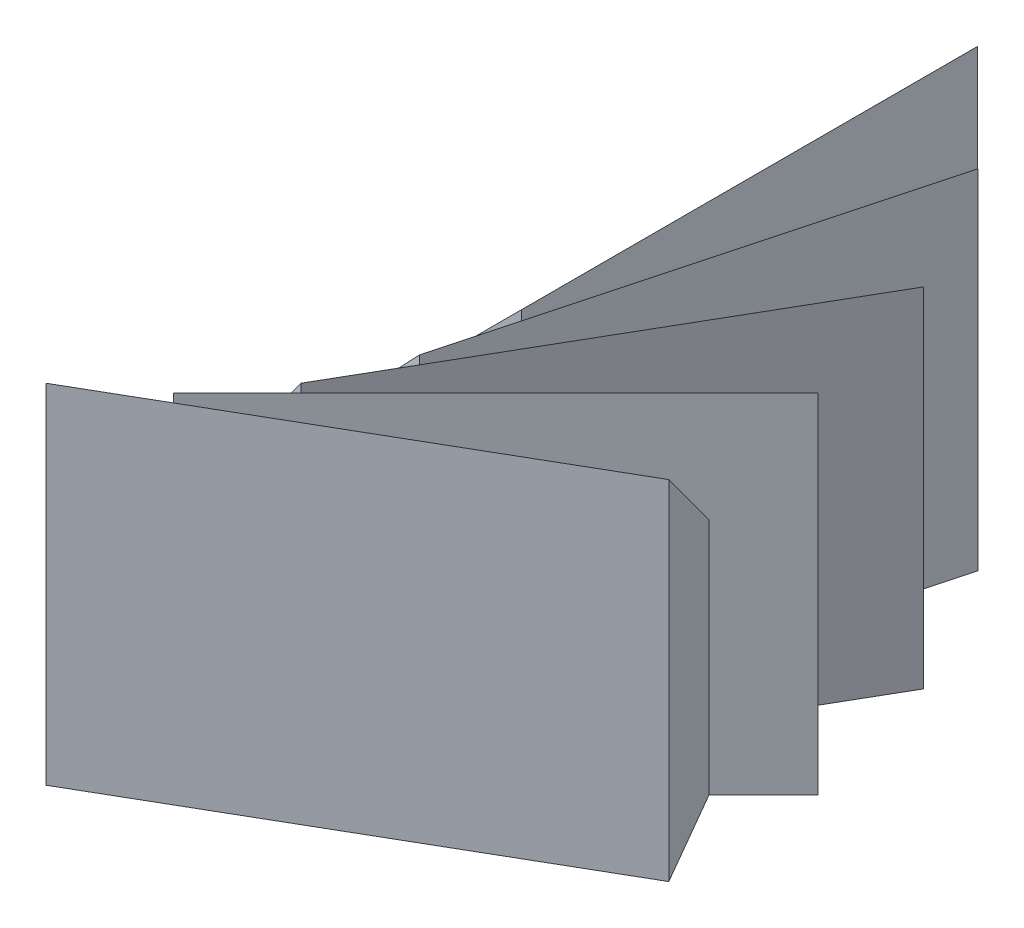
ISO-10303-21;
HEADER;
FILE_DESCRIPTION(('STEP AP214'),'2;1');
FILE_NAME('part.step','',(''),(''),'','','');
FILE_SCHEMA(('AUTOMOTIVE_DESIGN { 1 0 10303 214 1 1 1 1 }'));
ENDSEC;
DATA;
#1=APPLICATION_CONTEXT('core data for automotive mechanical design processes');
#2=APPLICATION_PROTOCOL_DEFINITION('international standard','automotive_design',2000,#1);
#3=PRODUCT_CONTEXT('',#1,'mechanical');
#4=PRODUCT('Part','Part','',(#3));
#5=PRODUCT_RELATED_PRODUCT_CATEGORY('part','',(#4));
#6=PRODUCT_DEFINITION_FORMATION('','',#4);
#7=PRODUCT_DEFINITION_CONTEXT('part definition',#1,'design');
#8=PRODUCT_DEFINITION('design','',#6,#7);
#9=PRODUCT_DEFINITION_SHAPE('','',#8);
#10=(LENGTH_UNIT() NAMED_UNIT(*) SI_UNIT(.MILLI.,.METRE.));
#11=(NAMED_UNIT(*) PLANE_ANGLE_UNIT() SI_UNIT($,.RADIAN.));
#12=(NAMED_UNIT(*) SI_UNIT($,.STERADIAN.) SOLID_ANGLE_UNIT());
#13=UNCERTAINTY_MEASURE_WITH_UNIT(LENGTH_MEASURE(1.E-05),#10,'distance_accuracy_value','');
#14=(GEOMETRIC_REPRESENTATION_CONTEXT(3) GLOBAL_UNCERTAINTY_ASSIGNED_CONTEXT((#13)) GLOBAL_UNIT_ASSIGNED_CONTEXT((#10,
#11,#12)) REPRESENTATION_CONTEXT('',''));
#15=CARTESIAN_POINT('',(0.,0.,0.));
#16=DIRECTION('',(0.,0.,1.));
#17=DIRECTION('',(1.,0.,0.));
#18=AXIS2_PLACEMENT_3D('',#15,#16,#17);
#19=CARTESIAN_POINT('',(69.6820604167687,0.,-19.));
#20=DIRECTION('',(0.,-1.,0.));
#21=DIRECTION('',(0.,0.,-1.));
#22=AXIS2_PLACEMENT_3D('',#19,#20,#21);
#23=PLANE('',#22);
#24=DIRECTION('',(0.499999999999998,0.,0.86602540378444));
#25=VECTOR('',#24,1.);
#26=CARTESIAN_POINT('',(62.4277714101868,0.,12.5647971321882));
#27=LINE('',#26,#25);
#28=CARTESIAN_POINT('',(55.173482403605,0.,0.));
#29=VERTEX_POINT('',#28);
#30=CARTESIAN_POINT('',(62.4277714101868,0.,12.5647971321882));
#31=VERTEX_POINT('',#30);
#32=EDGE_CURVE('E164',#29,#31,#27,.T.);
#33=ORIENTED_EDGE('',*,*,#32,.F.);
#34=DIRECTION('',(0.,0.,1.));
#35=VECTOR('',#34,1.);
#36=CARTESIAN_POINT('',(55.173482403605,0.,-19.));
#37=LINE('',#36,#35);
#38=CARTESIAN_POINT('',(55.173482403605,0.,-19.));
#39=VERTEX_POINT('',#38);
#40=EDGE_CURVE('E264',#39,#29,#37,.T.);
#41=ORIENTED_EDGE('',*,*,#40,.F.);
#42=DIRECTION('',(1.,0.,0.));
#43=VECTOR('',#42,1.);
#44=CARTESIAN_POINT('',(69.6820604167687,0.,-19.));
#45=LINE('',#44,#43);
#46=CARTESIAN_POINT('',(69.6820604167687,0.,-19.));
#47=VERTEX_POINT('',#46);
#48=EDGE_CURVE('E251',#39,#47,#45,.T.);
#49=ORIENTED_EDGE('',*,*,#48,.T.);
#50=DIRECTION('',(0.,0.,1.));
#51=VECTOR('',#50,1.);
#52=CARTESIAN_POINT('',(69.6820604167687,0.,-19.));
#53=LINE('',#52,#51);
#54=CARTESIAN_POINT('',(69.6820604167687,0.,-15.7826856658404));
#55=VERTEX_POINT('',#54);
#56=EDGE_CURVE('E261',#47,#55,#53,.T.);
#57=ORIENTED_EDGE('',*,*,#56,.T.);
#58=DIRECTION('',(0.965925826289068,0.,0.258819045102521));
#59=VECTOR('',#58,1.);
#60=CARTESIAN_POINT('',(74.1052544661975,0.,-14.5974943923298));
#61=LINE('',#60,#59);
#62=CARTESIAN_POINT('',(74.1052544661975,0.,-14.5974943923298));
#63=VERTEX_POINT('',#62);
#64=EDGE_CURVE('E226',#55,#63,#61,.T.);
#65=ORIENTED_EDGE('',*,*,#64,.T.);
#66=DIRECTION('',(-0.258819045102521,0.,0.965925826289068));
#67=VECTOR('',#66,1.);
#68=CARTESIAN_POINT('',(74.1052544661975,0.,-14.5974943923298));
#69=LINE('',#68,#67);
#70=CARTESIAN_POINT('',(73.2725522424356,0.,-11.4898073856751));
#71=VERTEX_POINT('',#70);
#72=EDGE_CURVE('E235',#63,#71,#69,.T.);
#73=ORIENTED_EDGE('',*,*,#72,.T.);
#74=DIRECTION('',(0.866025403784438,0.,0.500000000000001));
#75=VECTOR('',#74,1.);
#76=CARTESIAN_POINT('',(77.2382795357932,0.,-9.20019366532244));
#77=LINE('',#76,#75);
#78=CARTESIAN_POINT('',(77.2382795357932,0.,-9.20019366532244));
#79=VERTEX_POINT('',#78);
#80=EDGE_CURVE('E199',#71,#79,#77,.T.);
#81=ORIENTED_EDGE('',*,*,#80,.T.);
#82=DIRECTION('',(-0.500000000000001,0.,0.866025403784438));
#83=VECTOR('',#82,1.);
#84=CARTESIAN_POINT('',(77.2382795357932,0.,-9.20019366532244));
#85=LINE('',#84,#83);
#86=CARTESIAN_POINT('',(75.6296223687133,0.,-6.41391771998042));
#87=VERTEX_POINT('',#86);
#88=EDGE_CURVE('E208',#79,#87,#85,.T.);
#89=ORIENTED_EDGE('',*,*,#88,.T.);
#90=DIRECTION('',(0.707106781186546,0.,0.707106781186549));
#91=VECTOR('',#90,1.);
#92=CARTESIAN_POINT('',(78.8676251446315,0.,-3.17591494406224));
#93=LINE('',#92,#91);
#94=CARTESIAN_POINT('',(78.8676251446315,0.,-3.17591494406224));
#95=VERTEX_POINT('',#94);
#96=EDGE_CURVE('E174',#87,#95,#93,.T.);
#97=ORIENTED_EDGE('',*,*,#96,.T.);
#98=DIRECTION('',(-0.707106781186549,0.,0.707106781186546));
#99=VECTOR('',#98,1.);
#100=CARTESIAN_POINT('',(78.8676251446315,0.,-3.17591494406224));
#101=LINE('',#100,#99);
#102=CARTESIAN_POINT('',(76.5926403617386,0.,-0.90093016116931));
#103=VERTEX_POINT('',#102);
#104=EDGE_CURVE('E142',#95,#103,#101,.T.);
#105=ORIENTED_EDGE('',*,*,#104,.T.);
#106=DIRECTION('',(0.499999999999998,0.,0.86602540378444));
#107=VECTOR('',#106,1.);
#108=CARTESIAN_POINT('',(78.8822540820912,0.,3.06479713218821));
#109=LINE('',#108,#107);
#110=CARTESIAN_POINT('',(78.8822540820912,0.,3.06479713218821));
#111=VERTEX_POINT('',#110);
#112=EDGE_CURVE('E136',#103,#111,#109,.T.);
#113=ORIENTED_EDGE('',*,*,#112,.T.);
#114=DIRECTION('',(-0.86602540378444,0.,0.499999999999998));
#115=VECTOR('',#114,1.);
#116=CARTESIAN_POINT('',(78.8822540820912,0.,3.06479713218821));
#117=LINE('',#116,#115);
#118=EDGE_CURVE('E139',#111,#31,#117,.T.);
#119=ORIENTED_EDGE('',*,*,#118,.T.);
#120=EDGE_LOOP('',(#33,#41,#49,#57,#65,#73,#81,#89,#97,#105,#113,#119));
#121=FACE_BOUND('',#120,.T.);
#122=ADVANCED_FACE('F33',(#121),#23,.T.);
#123=CARTESIAN_POINT('',(55.173482403605,0.,-19.));
#124=DIRECTION('',(-0.707106781186548,0.707106781186548,0.));
#125=DIRECTION('',(-0.707106781186548,-0.707106781186548,0.));
#126=AXIS2_PLACEMENT_3D('',#123,#124,#125);
#127=PLANE('',#126);
#128=DIRECTION('',(-0.707106781186547,-0.707106781186547,0.));
#129=VECTOR('',#128,1.);
#130=CARTESIAN_POINT('',(55.173482403605,0.,0.));
#131=LINE('',#130,#129);
#132=CARTESIAN_POINT('',(69.6820604167687,14.5085780131637,0.));
#133=VERTEX_POINT('',#132);
#134=EDGE_CURVE('E255',#133,#29,#131,.T.);
#135=ORIENTED_EDGE('',*,*,#134,.F.);
#136=DIRECTION('',(0.,0.,1.));
#137=VECTOR('',#136,1.);
#138=CARTESIAN_POINT('',(69.6820604167687,14.5085780131637,-19.));
#139=LINE('',#138,#137);
#140=CARTESIAN_POINT('',(69.6820604167687,14.5085780131637,-19.));
#141=VERTEX_POINT('',#140);
#142=EDGE_CURVE('E267',#141,#133,#139,.T.);
#143=ORIENTED_EDGE('',*,*,#142,.F.);
#144=DIRECTION('',(-0.707106781186547,-0.707106781186547,0.));
#145=VECTOR('',#144,1.);
#146=CARTESIAN_POINT('',(55.173482403605,0.,-19.));
#147=LINE('',#146,#145);
#148=EDGE_CURVE('E258',#141,#39,#147,.T.);
#149=ORIENTED_EDGE('',*,*,#148,.T.);
#150=ORIENTED_EDGE('',*,*,#40,.T.);
#151=EDGE_LOOP('',(#135,#143,#149,#150));
#152=FACE_BOUND('',#151,.T.);
#153=ADVANCED_FACE('F304',(#152),#127,.T.);
#154=CARTESIAN_POINT('',(69.6820604167687,14.5085780131637,-19.));
#155=DIRECTION('',(1.,0.,0.));
#156=DIRECTION('',(0.,0.,-1.));
#157=AXIS2_PLACEMENT_3D('',#154,#155,#156);
#158=PLANE('',#157);
#159=DIRECTION('',(0.,0.250562807085732,0.968100345886375));
#160=VECTOR('',#159,1.);
#161=CARTESIAN_POINT('',(69.6820604167687,9.43641860314574,-17.6872285448914));
#162=LINE('',#161,#160);
#163=CARTESIAN_POINT('',(69.6820604167687,9.92935057245854,-15.7826856658404));
#164=VERTEX_POINT('',#163);
#165=CARTESIAN_POINT('',(69.6820604167687,14.0142102056446,0.));
#166=VERTEX_POINT('',#165);
#167=EDGE_CURVE('E46',#164,#166,#162,.T.);
#168=ORIENTED_EDGE('',*,*,#167,.F.);
#169=DIRECTION('',(0.,-1.,0.));
#170=VECTOR('',#169,1.);
#171=CARTESIAN_POINT('',(69.6820604167687,14.5085780131637,-15.7826856658404));
#172=LINE('',#171,#170);
#173=EDGE_CURVE('E11',#164,#55,#172,.T.);
#174=ORIENTED_EDGE('',*,*,#173,.T.);
#175=ORIENTED_EDGE('',*,*,#56,.F.);
#176=DIRECTION('',(0.,1.,0.));
#177=VECTOR('',#176,1.);
#178=CARTESIAN_POINT('',(69.6820604167687,14.5085780131637,-19.));
#179=LINE('',#178,#177);
#180=EDGE_CURVE('E254',#47,#141,#179,.T.);
#181=ORIENTED_EDGE('',*,*,#180,.T.);
#182=ORIENTED_EDGE('',*,*,#142,.T.);
#183=DIRECTION('',(0.,1.,0.));
#184=VECTOR('',#183,1.);
#185=CARTESIAN_POINT('',(69.6820604167687,14.5085780131637,0.));
#186=LINE('',#185,#184);
#187=EDGE_CURVE('E250',#166,#133,#186,.T.);
#188=ORIENTED_EDGE('',*,*,#187,.F.);
#189=EDGE_LOOP('',(#168,#174,#175,#181,#182,#188));
#190=FACE_BOUND('',#189,.T.);
#191=ADVANCED_FACE('F308',(#190),#158,.T.);
#192=CARTESIAN_POINT('',(0.,0.,-19.));
#193=DIRECTION('',(0.,0.,1.));
#194=DIRECTION('',(1.,0.,0.));
#195=AXIS2_PLACEMENT_3D('',#192,#193,#194);
#196=PLANE('',#195);
#197=ORIENTED_EDGE('',*,*,#48,.F.);
#198=ORIENTED_EDGE('',*,*,#148,.F.);
#199=ORIENTED_EDGE('',*,*,#180,.F.);
#200=EDGE_LOOP('',(#197,#198,#199));
#201=FACE_BOUND('',#200,.T.);
#202=ADVANCED_FACE('F314',(#201),#196,.F.);
#203=CARTESIAN_POINT('',(0.,0.,0.));
#204=DIRECTION('',(0.,0.,1.));
#205=DIRECTION('',(1.,0.,0.));
#206=AXIS2_PLACEMENT_3D('',#203,#204,#205);
#207=PLANE('',#206);
#208=DIRECTION('',(-0.719254596676404,-0.694746590606866,0.));
#209=VECTOR('',#208,1.);
#210=CARTESIAN_POINT('',(26.630740625656,-27.5701714364208,0.));
#211=LINE('',#210,#209);
#212=EDGE_CURVE('E40',#166,#29,#211,.T.);
#213=ORIENTED_EDGE('',*,*,#212,.F.);
#214=ORIENTED_EDGE('',*,*,#187,.T.);
#215=ORIENTED_EDGE('',*,*,#134,.T.);
#216=EDGE_LOOP('',(#213,#214,#215));
#217=FACE_BOUND('',#216,.T.);
#218=ADVANCED_FACE('F317',(#217),#207,.T.);
#219=CARTESIAN_POINT('',(60.0910442605529,0.,-18.3525906994923));
#220=DIRECTION('',(-0.683012701892219,0.707106781186548,-0.18301270189222));
#221=DIRECTION('',(-0.683012701892219,-0.707106781186548,-0.18301270189222));
#222=AXIS2_PLACEMENT_3D('',#219,#220,#221);
#223=PLANE('',#222);
#224=DIRECTION('',(-0.683012701892219,-0.707106781186547,-0.18301270189222));
#225=VECTOR('',#224,1.);
#226=CARTESIAN_POINT('',(60.0910442605529,0.,-18.3525906994923));
#227=LINE('',#226,#225);
#228=CARTESIAN_POINT('',(74.1052544661975,14.5085780131637,-14.5974943923298));
#229=VERTEX_POINT('',#228);
#230=EDGE_CURVE('E232',#229,#164,#227,.T.);
#231=ORIENTED_EDGE('',*,*,#230,.T.);
#232=ORIENTED_EDGE('',*,*,#167,.T.);
#233=ORIENTED_EDGE('',*,*,#212,.T.);
#234=DIRECTION('',(-0.683012701892219,-0.707106781186547,-0.18301270189222));
#235=VECTOR('',#234,1.);
#236=CARTESIAN_POINT('',(55.173482403605,0.,0.));
#237=LINE('',#236,#235);
#238=CARTESIAN_POINT('',(69.1876926092496,14.5085780131637,3.75509630716248));
#239=VERTEX_POINT('',#238);
#240=EDGE_CURVE('E229',#239,#29,#237,.T.);
#241=ORIENTED_EDGE('',*,*,#240,.F.);
#242=DIRECTION('',(-0.258819045102521,0.,0.965925826289068));
#243=VECTOR('',#242,1.);
#244=CARTESIAN_POINT('',(74.1052544661975,14.5085780131637,-14.5974943923298));
#245=LINE('',#244,#243);
#246=EDGE_CURVE('E239',#229,#239,#245,.T.);
#247=ORIENTED_EDGE('',*,*,#246,.F.);
#248=EDGE_LOOP('',(#231,#232,#233,#241,#247));
#249=FACE_BOUND('',#248,.T.);
#250=ADVANCED_FACE('F273',(#249),#223,.T.);
#251=CARTESIAN_POINT('',(74.1052544661975,14.5085780131637,-14.5974943923298));
#252=DIRECTION('',(0.965925826289068,0.,0.258819045102521));
#253=DIRECTION('',(0.258819045102521,0.,-0.965925826289068));
#254=AXIS2_PLACEMENT_3D('',#251,#252,#253);
#255=PLANE('',#254);
#256=DIRECTION('',(-0.250562807085732,0.250562807085732,0.935113126531029));
#257=VECTOR('',#256,1.);
#258=CARTESIAN_POINT('',(73.7654842117484,9.43641860314575,-13.3294545398253));
#259=LINE('',#258,#257);
#260=CARTESIAN_POINT('',(73.2725522424357,9.92935057245853,-11.4898073856751));
#261=VERTEX_POINT('',#260);
#262=CARTESIAN_POINT('',(69.1876926092496,14.0142102056446,3.75509630716247));
#263=VERTEX_POINT('',#262);
#264=EDGE_CURVE('E222',#261,#263,#259,.T.);
#265=ORIENTED_EDGE('',*,*,#264,.F.);
#266=DIRECTION('',(0.,-1.,0.));
#267=VECTOR('',#266,1.);
#268=CARTESIAN_POINT('',(73.2725522424356,14.5085780131637,-11.4898073856751));
#269=LINE('',#268,#267);
#270=EDGE_CURVE('E247',#261,#71,#269,.T.);
#271=ORIENTED_EDGE('',*,*,#270,.T.);
#272=ORIENTED_EDGE('',*,*,#72,.F.);
#273=DIRECTION('',(0.,1.,0.));
#274=VECTOR('',#273,1.);
#275=CARTESIAN_POINT('',(74.1052544661975,14.5085780131637,-14.5974943923298));
#276=LINE('',#275,#274);
#277=EDGE_CURVE('E228',#63,#229,#276,.T.);
#278=ORIENTED_EDGE('',*,*,#277,.T.);
#279=ORIENTED_EDGE('',*,*,#246,.T.);
#280=DIRECTION('',(0.,1.,0.));
#281=VECTOR('',#280,1.);
#282=CARTESIAN_POINT('',(69.1876926092496,14.5085780131637,3.75509630716248));
#283=LINE('',#282,#281);
#284=EDGE_CURVE('E225',#263,#239,#283,.T.);
#285=ORIENTED_EDGE('',*,*,#284,.F.);
#286=EDGE_LOOP('',(#265,#271,#272,#278,#279,#285));
#287=FACE_BOUND('',#286,.T.);
#288=ADVANCED_FACE('F323',(#287),#255,.T.);
#289=CARTESIAN_POINT('',(6.79755268060539,0.,-32.6325387301741));
#290=DIRECTION('',(-0.258819045102521,0.,0.965925826289068));
#291=DIRECTION('',(0.965925826289068,0.,0.258819045102521));
#292=AXIS2_PLACEMENT_3D('',#289,#290,#291);
#293=PLANE('',#292);
#294=ORIENTED_EDGE('',*,*,#173,.F.);
#295=ORIENTED_EDGE('',*,*,#230,.F.);
#296=ORIENTED_EDGE('',*,*,#277,.F.);
#297=ORIENTED_EDGE('',*,*,#64,.F.);
#298=EDGE_LOOP('',(#294,#295,#296,#297));
#299=FACE_BOUND('',#298,.T.);
#300=ADVANCED_FACE('F326',(#299),#293,.F.);
#301=CARTESIAN_POINT('',(1.87999082365748,0.,-14.2799480306818));
#302=DIRECTION('',(-0.258819045102521,0.,0.965925826289068));
#303=DIRECTION('',(0.965925826289068,0.,0.258819045102521));
#304=AXIS2_PLACEMENT_3D('',#301,#302,#303);
#305=PLANE('',#304);
#306=DIRECTION('',(-0.694746590606866,-0.694746590606866,-0.186156787897386));
#307=VECTOR('',#306,1.);
#308=CARTESIAN_POINT('',(27.6033109671842,-27.5701714364208,-7.38740517157659));
#309=LINE('',#308,#307);
#310=EDGE_CURVE('E242',#263,#29,#309,.T.);
#311=ORIENTED_EDGE('',*,*,#310,.F.);
#312=ORIENTED_EDGE('',*,*,#284,.T.);
#313=ORIENTED_EDGE('',*,*,#240,.T.);
#314=EDGE_LOOP('',(#311,#312,#313));
#315=FACE_BOUND('',#314,.T.);
#316=ADVANCED_FACE('F276',(#315),#305,.T.);
#317=CARTESIAN_POINT('',(64.673482403605,0.,-16.4544826719043));
#318=DIRECTION('',(-0.612372435695794,0.707106781186548,-0.353553390593275));
#319=DIRECTION('',(-0.612372435695794,-0.707106781186548,-0.353553390593275));
#320=AXIS2_PLACEMENT_3D('',#317,#318,#319);
#321=PLANE('',#320);
#322=DIRECTION('',(-0.612372435695794,-0.707106781186547,-0.353553390593274));
#323=VECTOR('',#322,1.);
#324=CARTESIAN_POINT('',(64.673482403605,0.,-16.4544826719043));
#325=LINE('',#324,#323);
#326=CARTESIAN_POINT('',(77.2382795357932,14.5085780131637,-9.20019366532244));
#327=VERTEX_POINT('',#326);
#328=EDGE_CURVE('E205',#327,#261,#325,.T.);
#329=ORIENTED_EDGE('',*,*,#328,.T.);
#330=ORIENTED_EDGE('',*,*,#264,.T.);
#331=ORIENTED_EDGE('',*,*,#310,.T.);
#332=DIRECTION('',(-0.612372435695794,-0.707106781186547,-0.353553390593274));
#333=VECTOR('',#332,1.);
#334=CARTESIAN_POINT('',(55.173482403605,0.,0.));
#335=LINE('',#334,#333);
#336=CARTESIAN_POINT('',(67.7382795357931,14.5085780131637,7.25428900658189));
#337=VERTEX_POINT('',#336);
#338=EDGE_CURVE('E202',#337,#29,#335,.T.);
#339=ORIENTED_EDGE('',*,*,#338,.F.);
#340=DIRECTION('',(-0.500000000000001,0.,0.866025403784438));
#341=VECTOR('',#340,1.);
#342=CARTESIAN_POINT('',(77.2382795357932,14.5085780131637,-9.20019366532244));
#343=LINE('',#342,#341);
#344=EDGE_CURVE('E212',#327,#337,#343,.T.);
#345=ORIENTED_EDGE('',*,*,#344,.F.);
#346=EDGE_LOOP('',(#329,#330,#331,#339,#345));
#347=FACE_BOUND('',#346,.T.);
#348=ADVANCED_FACE('F280',(#347),#321,.T.);
#349=CARTESIAN_POINT('',(77.2382795357932,14.5085780131637,-9.20019366532244));
#350=DIRECTION('',(0.866025403784438,0.,0.500000000000001));
#351=DIRECTION('',(0.500000000000001,0.,-0.866025403784438));
#352=AXIS2_PLACEMENT_3D('',#349,#350,#351);
#353=PLANE('',#352);
#354=DIRECTION('',(-0.484050172943188,0.250562807085732,0.838399492950102));
#355=VECTOR('',#354,1.);
#356=CARTESIAN_POINT('',(76.5818938082388,9.43641860314575,-8.06330023583531));
#357=LINE('',#356,#355);
#358=CARTESIAN_POINT('',(75.6296223687133,9.92935057245852,-6.41391771998042));
#359=VERTEX_POINT('',#358);
#360=CARTESIAN_POINT('',(67.7382795357931,14.0142102056445,7.25428900658187));
#361=VERTEX_POINT('',#360);
#362=EDGE_CURVE('E195',#359,#361,#357,.T.);
#363=ORIENTED_EDGE('',*,*,#362,.F.);
#364=DIRECTION('',(0.,-1.,0.));
#365=VECTOR('',#364,1.);
#366=CARTESIAN_POINT('',(75.6296223687133,14.5085780131637,-6.41391771998042));
#367=LINE('',#366,#365);
#368=EDGE_CURVE('E220',#359,#87,#367,.T.);
#369=ORIENTED_EDGE('',*,*,#368,.T.);
#370=ORIENTED_EDGE('',*,*,#88,.F.);
#371=DIRECTION('',(0.,1.,0.));
#372=VECTOR('',#371,1.);
#373=CARTESIAN_POINT('',(77.2382795357932,14.5085780131637,-9.20019366532244));
#374=LINE('',#373,#372);
#375=EDGE_CURVE('E201',#79,#327,#374,.T.);
#376=ORIENTED_EDGE('',*,*,#375,.T.);
#377=ORIENTED_EDGE('',*,*,#344,.T.);
#378=DIRECTION('',(0.,1.,0.));
#379=VECTOR('',#378,1.);
#380=CARTESIAN_POINT('',(67.7382795357931,14.5085780131637,7.25428900658189));
#381=LINE('',#380,#379);
#382=EDGE_CURVE('E198',#361,#337,#381,.T.);
#383=ORIENTED_EDGE('',*,*,#382,.F.);
#384=EDGE_LOOP('',(#363,#369,#370,#376,#377,#383));
#385=FACE_BOUND('',#384,.T.);
#386=ADVANCED_FACE('F335',(#385),#353,.T.);
#387=CARTESIAN_POINT('',(16.8918450268294,0.,-44.0412238737069));
#388=DIRECTION('',(-0.500000000000001,0.,0.866025403784438));
#389=DIRECTION('',(0.866025403784438,0.,0.500000000000001));
#390=AXIS2_PLACEMENT_3D('',#387,#388,#389);
#391=PLANE('',#390);
#392=ORIENTED_EDGE('',*,*,#270,.F.);
#393=ORIENTED_EDGE('',*,*,#328,.F.);
#394=ORIENTED_EDGE('',*,*,#375,.F.);
#395=ORIENTED_EDGE('',*,*,#80,.F.);
#396=EDGE_LOOP('',(#392,#393,#394,#395));
#397=FACE_BOUND('',#396,.T.);
#398=ADVANCED_FACE('F338',(#397),#391,.F.);
#399=CARTESIAN_POINT('',(7.39184502682939,0.,-27.5867412018025));
#400=DIRECTION('',(-0.500000000000001,0.,0.866025403784438));
#401=DIRECTION('',(0.866025403784438,0.,0.500000000000001));
#402=AXIS2_PLACEMENT_3D('',#399,#400,#401);
#403=PLANE('',#402);
#404=DIRECTION('',(-0.622892752510496,-0.694746590606866,-0.359627298338203));
#405=VECTOR('',#404,1.);
#406=CARTESIAN_POINT('',(30.4547429302418,-27.5701714364208,-14.2713708889745));
#407=LINE('',#406,#405);
#408=EDGE_CURVE('E215',#361,#29,#407,.T.);
#409=ORIENTED_EDGE('',*,*,#408,.F.);
#410=ORIENTED_EDGE('',*,*,#382,.T.);
#411=ORIENTED_EDGE('',*,*,#338,.T.);
#412=EDGE_LOOP('',(#409,#410,#411));
#413=FACE_BOUND('',#412,.T.);
#414=ADVANCED_FACE('F282',(#413),#403,.T.);
#415=CARTESIAN_POINT('',(68.6085112461494,0.,-13.4350288425444));
#416=DIRECTION('',(-0.499999999999999,0.707106781186548,-0.500000000000001));
#417=DIRECTION('',(-0.499999999999999,-0.707106781186548,-0.500000000000001));
#418=AXIS2_PLACEMENT_3D('',#415,#416,#417);
#419=PLANE('',#418);
#420=DIRECTION('',(-0.499999999999999,-0.707106781186547,-0.500000000000001));
#421=VECTOR('',#420,1.);
#422=CARTESIAN_POINT('',(68.6085112461494,0.,-13.4350288425444));
#423=LINE('',#422,#421);
#424=CARTESIAN_POINT('',(78.8676251446315,14.5085780131637,-3.17591494406224));
#425=VERTEX_POINT('',#424);
#426=EDGE_CURVE('E180',#425,#359,#423,.T.);
#427=ORIENTED_EDGE('',*,*,#426,.T.);
#428=ORIENTED_EDGE('',*,*,#362,.T.);
#429=ORIENTED_EDGE('',*,*,#408,.T.);
#430=DIRECTION('',(-0.499999999999999,-0.707106781186547,-0.500000000000001));
#431=VECTOR('',#430,1.);
#432=CARTESIAN_POINT('',(55.173482403605,0.,0.));
#433=LINE('',#432,#431);
#434=CARTESIAN_POINT('',(65.4325963020871,14.5085780131637,10.2591138984822));
#435=VERTEX_POINT('',#434);
#436=EDGE_CURVE('E177',#435,#29,#433,.T.);
#437=ORIENTED_EDGE('',*,*,#436,.F.);
#438=DIRECTION('',(-0.707106781186549,0.,0.707106781186546));
#439=VECTOR('',#438,1.);
#440=CARTESIAN_POINT('',(78.8676251446315,14.5085780131637,-3.17591494406224));
#441=LINE('',#440,#439);
#442=EDGE_CURVE('E186',#425,#435,#441,.T.);
#443=ORIENTED_EDGE('',*,*,#442,.F.);
#444=EDGE_LOOP('',(#427,#428,#429,#437,#443));
#445=FACE_BOUND('',#444,.T.);
#446=ADVANCED_FACE('F286',(#445),#419,.T.);
#447=CARTESIAN_POINT('',(78.8676251446315,14.5085780131637,-3.17591494406224));
#448=DIRECTION('',(0.707106781186546,0.,0.707106781186549));
#449=DIRECTION('',(0.707106781186549,0.,-0.707106781186546));
#450=AXIS2_PLACEMENT_3D('',#447,#448,#449);
#451=PLANE('',#450);
#452=DIRECTION('',(-0.684550319445299,0.250562807085732,0.684550319445297));
#453=VECTOR('',#452,1.);
#454=CARTESIAN_POINT('',(77.9393555465761,9.43641860314575,-2.2476453460068));
#455=LINE('',#454,#453);
#456=CARTESIAN_POINT('',(76.5926403617386,9.92935057245853,-0.90093016116931));
#457=VERTEX_POINT('',#456);
#458=CARTESIAN_POINT('',(65.4325963020871,14.0142102056446,10.2591138984821));
#459=VERTEX_POINT('',#458);
#460=EDGE_CURVE('E169',#457,#459,#455,.T.);
#461=ORIENTED_EDGE('',*,*,#460,.F.);
#462=DIRECTION('',(0.,-1.,0.));
#463=VECTOR('',#462,1.);
#464=CARTESIAN_POINT('',(76.5926403617386,14.5085780131637,-0.900930161169311));
#465=LINE('',#464,#463);
#466=EDGE_CURVE('E193',#457,#103,#465,.T.);
#467=ORIENTED_EDGE('',*,*,#466,.T.);
#468=ORIENTED_EDGE('',*,*,#104,.F.);
#469=DIRECTION('',(0.,1.,0.));
#470=VECTOR('',#469,1.);
#471=CARTESIAN_POINT('',(78.8676251446315,14.5085780131637,-3.17591494406224));
#472=LINE('',#471,#470);
#473=EDGE_CURVE('E176',#95,#425,#472,.T.);
#474=ORIENTED_EDGE('',*,*,#473,.T.);
#475=ORIENTED_EDGE('',*,*,#442,.T.);
#476=DIRECTION('',(0.,1.,0.));
#477=VECTOR('',#476,1.);
#478=CARTESIAN_POINT('',(65.4325963020871,14.5085780131637,10.2591138984822));
#479=LINE('',#478,#477);
#480=EDGE_CURVE('E173',#459,#435,#479,.T.);
#481=ORIENTED_EDGE('',*,*,#480,.F.);
#482=EDGE_LOOP('',(#461,#467,#468,#474,#475,#481));
#483=FACE_BOUND('',#482,.T.);
#484=ADVANCED_FACE('F347',(#483),#451,.T.);
#485=CARTESIAN_POINT('',(29.5949676968837,0.,-52.4485723918102));
#486=DIRECTION('',(-0.707106781186549,0.,0.707106781186546));
#487=DIRECTION('',(0.707106781186546,0.,0.707106781186549));
#488=AXIS2_PLACEMENT_3D('',#485,#486,#487);
#489=PLANE('',#488);
#490=ORIENTED_EDGE('',*,*,#368,.F.);
#491=ORIENTED_EDGE('',*,*,#426,.F.);
#492=ORIENTED_EDGE('',*,*,#473,.F.);
#493=ORIENTED_EDGE('',*,*,#96,.F.);
#494=EDGE_LOOP('',(#490,#491,#492,#493));
#495=FACE_BOUND('',#494,.T.);
#496=ADVANCED_FACE('F350',(#495),#489,.F.);
#497=CARTESIAN_POINT('',(16.1599388543393,0.,-39.0135435492658));
#498=DIRECTION('',(-0.707106781186549,0.,0.707106781186546));
#499=DIRECTION('',(0.707106781186546,0.,0.707106781186549));
#500=AXIS2_PLACEMENT_3D('',#497,#498,#499);
#501=PLANE('',#500);
#502=DIRECTION('',(-0.508589802709479,-0.694746590606866,-0.508589802709481));
#503=VECTOR('',#502,1.);
#504=CARTESIAN_POINT('',(34.9907161387607,-27.5701714364208,-20.1827662648443));
#505=LINE('',#504,#503);
#506=EDGE_CURVE('E189',#459,#29,#505,.T.);
#507=ORIENTED_EDGE('',*,*,#506,.F.);
#508=ORIENTED_EDGE('',*,*,#480,.T.);
#509=ORIENTED_EDGE('',*,*,#436,.T.);
#510=EDGE_LOOP('',(#507,#508,#509));
#511=FACE_BOUND('',#510,.T.);
#512=ADVANCED_FACE('F288',(#511),#501,.T.);
#513=CARTESIAN_POINT('',(71.6279650755093,0.,-9.49999999999997));
#514=DIRECTION('',(-0.353553390593272,0.707106781186548,-0.612372435695795));
#515=DIRECTION('',(-0.353553390593272,-0.707106781186548,-0.612372435695795));
#516=AXIS2_PLACEMENT_3D('',#513,#514,#515);
#517=PLANE('',#516);
#518=DIRECTION('',(-0.353553390593272,-0.707106781186547,-0.612372435695795));
#519=VECTOR('',#518,1.);
#520=CARTESIAN_POINT('',(71.6279650755093,0.,-9.49999999999997));
#521=LINE('',#520,#519);
#522=CARTESIAN_POINT('',(78.8822540820912,14.5085780131637,3.06479713218821));
#523=VERTEX_POINT('',#522);
#524=EDGE_CURVE('E157',#523,#457,#521,.T.);
#525=ORIENTED_EDGE('',*,*,#524,.T.);
#526=ORIENTED_EDGE('',*,*,#460,.T.);
#527=ORIENTED_EDGE('',*,*,#506,.T.);
#528=DIRECTION('',(-0.353553390593272,-0.707106781186547,-0.612372435695795));
#529=VECTOR('',#528,1.);
#530=CARTESIAN_POINT('',(55.173482403605,0.,0.));
#531=LINE('',#530,#529);
#532=CARTESIAN_POINT('',(62.4277714101868,14.5085780131637,12.5647971321882));
#533=VERTEX_POINT('',#532);
#534=EDGE_CURVE('E147',#533,#29,#531,.T.);
#535=ORIENTED_EDGE('',*,*,#534,.F.);
#536=DIRECTION('',(-0.86602540378444,0.,0.499999999999998));
#537=VECTOR('',#536,1.);
#538=CARTESIAN_POINT('',(78.8822540820912,14.5085780131637,3.06479713218821));
#539=LINE('',#538,#537);
#540=EDGE_CURVE('E156',#523,#533,#539,.T.);
#541=ORIENTED_EDGE('',*,*,#540,.F.);
#542=EDGE_LOOP('',(#525,#526,#527,#535,#541));
#543=FACE_BOUND('',#542,.T.);
#544=ADVANCED_FACE('F292',(#543),#517,.T.);
#545=CARTESIAN_POINT('',(78.8822540820912,14.5085780131637,3.06479713218821));
#546=DIRECTION('',(0.499999999999998,0.,0.86602540378444));
#547=DIRECTION('',(0.86602540378444,0.,-0.499999999999998));
#548=AXIS2_PLACEMENT_3D('',#545,#546,#547);
#549=PLANE('',#548);
#550=DIRECTION('',(0.,1.,0.));
#551=VECTOR('',#550,1.);
#552=CARTESIAN_POINT('',(62.4277714101868,14.5085780131637,12.5647971321882));
#553=LINE('',#552,#551);
#554=EDGE_CURVE('E154',#31,#533,#553,.T.);
#555=ORIENTED_EDGE('',*,*,#554,.F.);
#556=ORIENTED_EDGE('',*,*,#118,.F.);
#557=DIRECTION('',(0.,1.,0.));
#558=VECTOR('',#557,1.);
#559=CARTESIAN_POINT('',(78.8822540820912,14.5085780131637,3.06479713218821));
#560=LINE('',#559,#558);
#561=EDGE_CURVE('E146',#111,#523,#560,.T.);
#562=ORIENTED_EDGE('',*,*,#561,.T.);
#563=ORIENTED_EDGE('',*,*,#540,.T.);
#564=EDGE_LOOP('',(#555,#556,#562,#563));
#565=FACE_BOUND('',#564,.T.);
#566=ADVANCED_FACE('F151',(#565),#549,.T.);
#567=CARTESIAN_POINT('',(44.041223873707,0.,-57.2816373767757));
#568=DIRECTION('',(-0.86602540378444,0.,0.499999999999998));
#569=DIRECTION('',(0.499999999999998,0.,0.86602540378444));
#570=AXIS2_PLACEMENT_3D('',#567,#568,#569);
#571=PLANE('',#570);
#572=ORIENTED_EDGE('',*,*,#466,.F.);
#573=ORIENTED_EDGE('',*,*,#524,.F.);
#574=ORIENTED_EDGE('',*,*,#561,.F.);
#575=ORIENTED_EDGE('',*,*,#112,.F.);
#576=EDGE_LOOP('',(#572,#573,#574,#575));
#577=FACE_BOUND('',#576,.T.);
#578=ADVANCED_FACE('F159',(#577),#571,.F.);
#579=CARTESIAN_POINT('',(27.5867412018026,0.,-47.7816373767757));
#580=DIRECTION('',(-0.86602540378444,0.,0.499999999999998));
#581=DIRECTION('',(0.499999999999998,0.,0.86602540378444));
#582=AXIS2_PLACEMENT_3D('',#579,#580,#581);
#583=PLANE('',#582);
#584=ORIENTED_EDGE('',*,*,#32,.T.);
#585=ORIENTED_EDGE('',*,*,#554,.T.);
#586=ORIENTED_EDGE('',*,*,#534,.T.);
#587=EDGE_LOOP('',(#584,#585,#586));
#588=FACE_BOUND('',#587,.T.);
#589=ADVANCED_FACE('F295',(#588),#583,.T.);
#590=CLOSED_SHELL('',(#122,#153,#191,#202,#218,#250,#288,#300,#316,#348,#386,#398,#414,#446,
#484,#496,#512,#544,#566,#578,#589));
#591=MANIFOLD_SOLID_BREP('B2',#590);
#592=ADVANCED_BREP_SHAPE_REPRESENTATION('',(#18,#591),#14);
#593=SHAPE_DEFINITION_REPRESENTATION(#9,#592);
ENDSEC;
END-ISO-10303-21;
